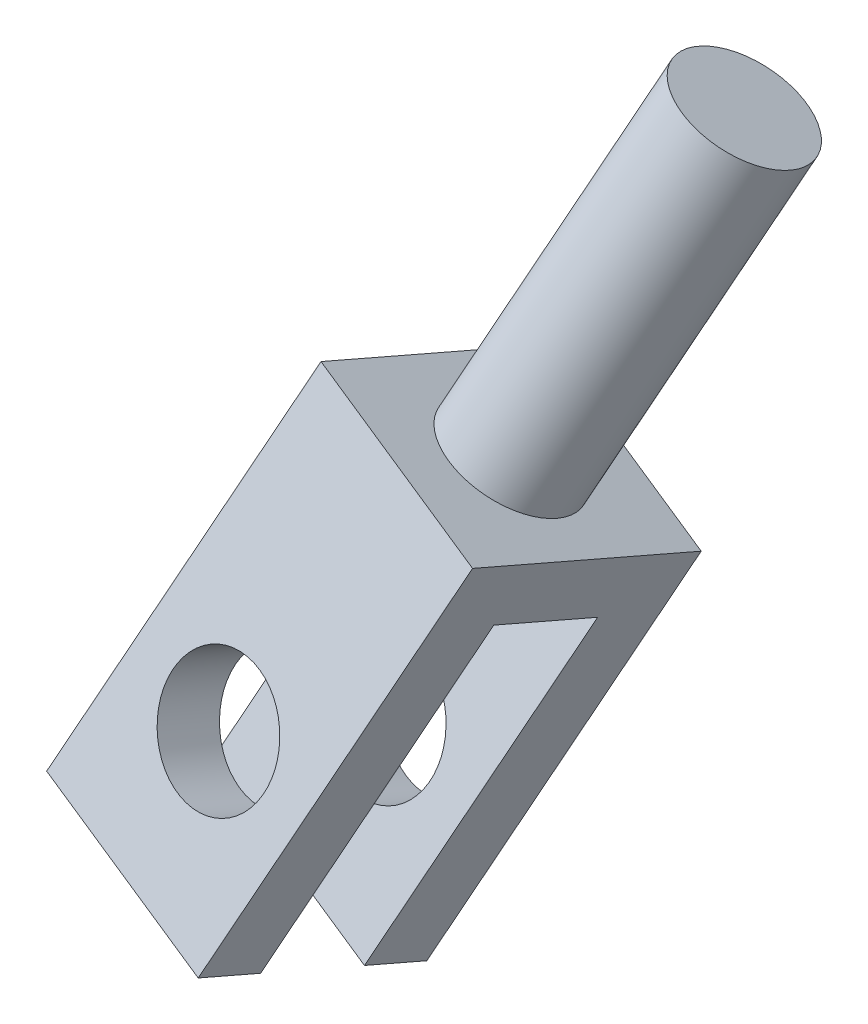
ISO-10303-21;
HEADER;
FILE_DESCRIPTION(('STEP AP214'),'2;1');
FILE_NAME('part.step','',(''),(''),'','','');
FILE_SCHEMA(('AUTOMOTIVE_DESIGN { 1 0 10303 214 1 1 1 1 }'));
ENDSEC;
DATA;
#1=APPLICATION_CONTEXT('core data for automotive mechanical design processes');
#2=APPLICATION_PROTOCOL_DEFINITION('international standard','automotive_design',2000,#1);
#3=PRODUCT_CONTEXT('',#1,'mechanical');
#4=PRODUCT('Part','Part','',(#3));
#5=PRODUCT_RELATED_PRODUCT_CATEGORY('part','',(#4));
#6=PRODUCT_DEFINITION_FORMATION('','',#4);
#7=PRODUCT_DEFINITION_CONTEXT('part definition',#1,'design');
#8=PRODUCT_DEFINITION('design','',#6,#7);
#9=PRODUCT_DEFINITION_SHAPE('','',#8);
#10=(LENGTH_UNIT() NAMED_UNIT(*) SI_UNIT(.MILLI.,.METRE.));
#11=(NAMED_UNIT(*) PLANE_ANGLE_UNIT() SI_UNIT($,.RADIAN.));
#12=(NAMED_UNIT(*) SI_UNIT($,.STERADIAN.) SOLID_ANGLE_UNIT());
#13=UNCERTAINTY_MEASURE_WITH_UNIT(LENGTH_MEASURE(1.E-05),#10,'distance_accuracy_value','');
#14=(GEOMETRIC_REPRESENTATION_CONTEXT(3) GLOBAL_UNCERTAINTY_ASSIGNED_CONTEXT((#13)) GLOBAL_UNIT_ASSIGNED_CONTEXT((#10,
#11,#12)) REPRESENTATION_CONTEXT('',''));
#15=CARTESIAN_POINT('',(0.,0.,0.));
#16=DIRECTION('',(0.,0.,1.));
#17=DIRECTION('',(1.,0.,0.));
#18=AXIS2_PLACEMENT_3D('',#15,#16,#17);
#19=CARTESIAN_POINT('',(636.080806585949,8.59855871838625,-207.638908513672));
#20=DIRECTION('',(0.354162422945148,0.881836565444647,-0.311341050968886));
#21=DIRECTION('',(-0.927957693562159,0.372685549704839,0.));
#22=AXIS2_PLACEMENT_3D('',#19,#20,#21);
#23=PLANE('',#22);
#24=DIRECTION('',(-0.0784836857791925,0.359772078695606,0.929733490016121));
#25=VECTOR('',#24,1.);
#26=CARTESIAN_POINT('',(645.399654633,5.55014399535678,-205.672633163574));
#27=LINE('',#26,#25);
#28=CARTESIAN_POINT('',(645.399654633,5.55014399535678,-205.672633163574));
#29=VERTEX_POINT('',#28);
#30=CARTESIAN_POINT('',(645.164203575662,6.62946023144359,-202.883432693526));
#31=VERTEX_POINT('',#30);
#32=EDGE_CURVE('E138',#29,#31,#27,.T.);
#33=ORIENTED_EDGE('',*,*,#32,.T.);
#34=DIRECTION('',(0.93188480470503,-0.304841472302947,0.196627535009822));
#35=VECTOR('',#34,1.);
#36=CARTESIAN_POINT('',(635.845355528612,9.67787495447306,-204.849708043624));
#37=LINE('',#36,#35);
#38=CARTESIAN_POINT('',(635.845355528612,9.67787495447306,-204.849708043624));
#39=VERTEX_POINT('',#38);
#40=EDGE_CURVE('E48',#39,#31,#37,.T.);
#41=ORIENTED_EDGE('',*,*,#40,.F.);
#42=DIRECTION('',(-0.0784836857791925,0.359772078695606,0.929733490016121));
#43=VECTOR('',#42,1.);
#44=CARTESIAN_POINT('',(636.080806585949,8.59855871838625,-207.638908513672));
#45=LINE('',#44,#43);
#46=CARTESIAN_POINT('',(636.080806585949,8.59855871838625,-207.638908513672));
#47=VERTEX_POINT('',#46);
#48=EDGE_CURVE('E153',#47,#39,#45,.T.);
#49=ORIENTED_EDGE('',*,*,#48,.F.);
#50=DIRECTION('',(0.93188480470503,-0.304841472302947,0.196627535009822));
#51=VECTOR('',#50,1.);
#52=CARTESIAN_POINT('',(636.080806585949,8.59855871838625,-207.638908513672));
#53=LINE('',#52,#51);
#54=EDGE_CURVE('E134',#47,#29,#53,.T.);
#55=ORIENTED_EDGE('',*,*,#54,.T.);
#56=EDGE_LOOP('',(#33,#41,#49,#55));
#57=FACE_BOUND('',#56,.T.);
#58=ADVANCED_FACE('F39',(#57),#23,.F.);
#59=CARTESIAN_POINT('',(635.845355528612,9.67787495447306,-204.849708043624));
#60=DIRECTION('',(0.0784836857792088,-0.359772078695604,-0.92973349001612));
#61=DIRECTION('',(0.,0.932610221230822,-0.36088526605529));
#62=AXIS2_PLACEMENT_3D('',#59,#60,#61);
#63=PLANE('',#62);
#64=CARTESIAN_POINT('',(642.983916512753,14.3265235510708,-206.045957725357));
#65=DIRECTION('',(0.0784836857792088,-0.359772078695604,-0.92973349001612));
#66=DIRECTION('',(0.,0.932610221230822,-0.36088526605529));
#67=AXIS2_PLACEMENT_3D('',#64,#65,#66);
#68=CIRCLE('',#67,3.00000000000005);
#69=CARTESIAN_POINT('',(642.983916512753,17.1243542147634,-207.128613523523));
#70=VERTEX_POINT('',#69);
#71=EDGE_CURVE('E142',#70,#70,#68,.T.);
#72=ORIENTED_EDGE('',*,*,#71,.T.);
#73=EDGE_LOOP('',(#72));
#74=FACE_BOUND('',#73,.T.);
#75=DIRECTION('',(0.354162422945148,0.88183656544465,-0.31134105096888));
#76=VECTOR('',#75,1.);
#77=CARTESIAN_POINT('',(645.164203575662,6.62946023144359,-202.883432693526));
#78=LINE('',#77,#76);
#79=CARTESIAN_POINT('',(652.247452034565,24.2661915403366,-209.110253712903));
#80=VERTEX_POINT('',#79);
#81=EDGE_CURVE('E141',#31,#80,#78,.T.);
#82=ORIENTED_EDGE('',*,*,#81,.T.);
#83=DIRECTION('',(0.93188480470503,-0.304841472302947,0.196627535009822));
#84=VECTOR('',#83,1.);
#85=CARTESIAN_POINT('',(642.928603987515,27.3146062633661,-211.076529063002));
#86=LINE('',#85,#84);
#87=CARTESIAN_POINT('',(642.928603987515,27.3146062633661,-211.076529063002));
#88=VERTEX_POINT('',#87);
#89=EDGE_CURVE('E163',#88,#80,#86,.T.);
#90=ORIENTED_EDGE('',*,*,#89,.F.);
#91=DIRECTION('',(0.354162422945148,0.88183656544465,-0.31134105096888));
#92=VECTOR('',#91,1.);
#93=CARTESIAN_POINT('',(635.845355528612,9.67787495447306,-204.849708043624));
#94=LINE('',#93,#92);
#95=EDGE_CURVE('E101',#39,#88,#94,.T.);
#96=ORIENTED_EDGE('',*,*,#95,.F.);
#97=ORIENTED_EDGE('',*,*,#40,.T.);
#98=EDGE_LOOP('',(#82,#90,#96,#97));
#99=FACE_BOUND('',#98,.T.);
#100=ADVANCED_FACE('F166',(#74,#99),#63,.F.);
#101=CARTESIAN_POINT('',(642.928603987515,27.3146062633661,-211.076529063002));
#102=DIRECTION('',(-0.354162422945148,-0.881836565444649,0.311341050968882));
#103=DIRECTION('',(0.927957693562159,-0.372685549704838,0.));
#104=AXIS2_PLACEMENT_3D('',#101,#102,#103);
#105=PLANE('',#104);
#106=CARTESIAN_POINT('',(648.019688282826,23.8116524690256,-215.206925583041));
#107=DIRECTION('',(0.354162422945148,0.881836565444649,-0.311341050968882));
#108=DIRECTION('',(-0.927957693562159,0.372685549704838,0.));
#109=AXIS2_PLACEMENT_3D('',#106,#107,#108);
#110=CIRCLE('',#109,3.00000000000005);
#111=CARTESIAN_POINT('',(645.235815202139,24.9297091181401,-215.206925583041));
#112=VERTEX_POINT('',#111);
#113=EDGE_CURVE('E11',#112,#112,#110,.T.);
#114=ORIENTED_EDGE('',*,*,#113,.F.);
#115=EDGE_LOOP('',(#114));
#116=FACE_BOUND('',#115,.T.);
#117=DIRECTION('',(0.0784836857792091,-0.359772078695606,-0.929733490016119));
#118=VECTOR('',#117,1.);
#119=CARTESIAN_POINT('',(652.247452034565,24.2661915403366,-209.110253712903));
#120=LINE('',#119,#118);
#121=CARTESIAN_POINT('',(653.110772578136,20.3086986746849,-219.337322103081));
#122=VERTEX_POINT('',#121);
#123=EDGE_CURVE('E144',#80,#122,#120,.T.);
#124=ORIENTED_EDGE('',*,*,#123,.T.);
#125=DIRECTION('',(0.93188480470503,-0.304841472302947,0.196627535009822));
#126=VECTOR('',#125,1.);
#127=CARTESIAN_POINT('',(643.791924531086,23.3571133977144,-221.303597453179));
#128=LINE('',#127,#126);
#129=CARTESIAN_POINT('',(643.791924531086,23.3571133977144,-221.303597453179));
#130=VERTEX_POINT('',#129);
#131=EDGE_CURVE('E160',#130,#122,#128,.T.);
#132=ORIENTED_EDGE('',*,*,#131,.F.);
#133=DIRECTION('',(0.0784836857792091,-0.359772078695606,-0.929733490016119));
#134=VECTOR('',#133,1.);
#135=CARTESIAN_POINT('',(642.928603987515,27.3146062633661,-211.076529063002));
#136=LINE('',#135,#134);
#137=EDGE_CURVE('E184',#88,#130,#136,.T.);
#138=ORIENTED_EDGE('',*,*,#137,.F.);
#139=ORIENTED_EDGE('',*,*,#89,.T.);
#140=EDGE_LOOP('',(#124,#132,#138,#139));
#141=FACE_BOUND('',#140,.T.);
#142=ADVANCED_FACE('F177',(#116,#141),#105,.F.);
#143=CARTESIAN_POINT('',(643.791924531086,23.3571133977144,-221.303597453179));
#144=DIRECTION('',(-0.0784836857792086,0.359772078695605,0.92973349001612));
#145=DIRECTION('',(0.,-0.932610221230822,0.36088526605529));
#146=AXIS2_PLACEMENT_3D('',#143,#144,#145);
#147=PLANE('',#146);
#148=CARTESIAN_POINT('',(643.847237056324,10.3690306854192,-216.273026115534));
#149=DIRECTION('',(-0.0784836857792086,0.359772078695605,0.92973349001612));
#150=DIRECTION('',(0.,-0.932610221230822,0.36088526605529));
#151=AXIS2_PLACEMENT_3D('',#148,#149,#150);
#152=CIRCLE('',#151,3.00000000000005);
#153=CARTESIAN_POINT('',(643.847237056324,7.57120002172667,-215.190370317369));
#154=VERTEX_POINT('',#153);
#155=EDGE_CURVE('E192',#154,#154,#152,.T.);
#156=ORIENTED_EDGE('',*,*,#155,.T.);
#157=EDGE_LOOP('',(#156));
#158=FACE_BOUND('',#157,.T.);
#159=DIRECTION('',(-0.354162422945148,-0.881836565444649,0.31134105096888));
#160=VECTOR('',#159,1.);
#161=CARTESIAN_POINT('',(653.110772578136,20.3086986746849,-219.337322103081));
#162=LINE('',#161,#160);
#163=CARTESIAN_POINT('',(646.027524119233,2.67196736579195,-213.110501083703));
#164=VERTEX_POINT('',#163);
#165=EDGE_CURVE('E146',#122,#164,#162,.T.);
#166=ORIENTED_EDGE('',*,*,#165,.T.);
#167=DIRECTION('',(0.93188480470503,-0.304841472302947,0.196627535009822));
#168=VECTOR('',#167,1.);
#169=CARTESIAN_POINT('',(636.708676072183,5.72038208882142,-215.076776433801));
#170=LINE('',#169,#168);
#171=CARTESIAN_POINT('',(636.708676072183,5.72038208882142,-215.076776433801));
#172=VERTEX_POINT('',#171);
#173=EDGE_CURVE('E157',#172,#164,#170,.T.);
#174=ORIENTED_EDGE('',*,*,#173,.F.);
#175=DIRECTION('',(-0.354162422945148,-0.881836565444649,0.31134105096888));
#176=VECTOR('',#175,1.);
#177=CARTESIAN_POINT('',(643.791924531086,23.3571133977144,-221.303597453179));
#178=LINE('',#177,#176);
#179=EDGE_CURVE('E183',#130,#172,#178,.T.);
#180=ORIENTED_EDGE('',*,*,#179,.F.);
#181=ORIENTED_EDGE('',*,*,#131,.T.);
#182=EDGE_LOOP('',(#166,#174,#180,#181));
#183=FACE_BOUND('',#182,.T.);
#184=ADVANCED_FACE('F181',(#158,#183),#147,.F.);
#185=CARTESIAN_POINT('',(636.708676072183,5.72038208882142,-215.076776433801));
#186=DIRECTION('',(0.354162422945147,0.881836565444652,-0.311341050968874));
#187=DIRECTION('',(-0.92795769356216,0.372685549704837,0.));
#188=AXIS2_PLACEMENT_3D('',#185,#186,#187);
#189=PLANE('',#188);
#190=DIRECTION('',(-0.0784836857792293,0.359772078695605,0.929733490016118));
#191=VECTOR('',#190,1.);
#192=CARTESIAN_POINT('',(646.027524119233,2.67196736579195,-213.110501083703));
#193=LINE('',#192,#191);
#194=CARTESIAN_POINT('',(645.792073061896,3.75128360187876,-210.321300613655));
#195=VERTEX_POINT('',#194);
#196=EDGE_CURVE('E148',#164,#195,#193,.T.);
#197=ORIENTED_EDGE('',*,*,#196,.T.);
#198=DIRECTION('',(0.93188480470503,-0.304841472302947,0.196627535009822));
#199=VECTOR('',#198,1.);
#200=CARTESIAN_POINT('',(636.473225014846,6.79969832490824,-212.287575963753));
#201=LINE('',#200,#199);
#202=CARTESIAN_POINT('',(636.473225014846,6.79969832490824,-212.287575963753));
#203=VERTEX_POINT('',#202);
#204=EDGE_CURVE('E129',#203,#195,#201,.T.);
#205=ORIENTED_EDGE('',*,*,#204,.F.);
#206=DIRECTION('',(-0.0784836857792293,0.359772078695605,0.929733490016118));
#207=VECTOR('',#206,1.);
#208=CARTESIAN_POINT('',(636.708676072183,5.72038208882142,-215.076776433801));
#209=LINE('',#208,#207);
#210=EDGE_CURVE('E120',#172,#203,#209,.T.);
#211=ORIENTED_EDGE('',*,*,#210,.F.);
#212=ORIENTED_EDGE('',*,*,#173,.T.);
#213=EDGE_LOOP('',(#197,#205,#211,#212));
#214=FACE_BOUND('',#213,.T.);
#215=ADVANCED_FACE('F225',(#214),#189,.F.);
#216=CARTESIAN_POINT('',(636.473225014846,6.79969832490824,-212.287575963753));
#217=DIRECTION('',(0.0784836857792086,-0.359772078695605,-0.92973349001612));
#218=DIRECTION('',(0.,0.932610221230822,-0.36088526605529));
#219=AXIS2_PLACEMENT_3D('',#216,#217,#218);
#220=PLANE('',#219);
#221=CARTESIAN_POINT('',(643.611785998987,11.448346921506,-213.483825645486));
#222=DIRECTION('',(0.0784836857792086,-0.359772078695605,-0.92973349001612));
#223=DIRECTION('',(0.,0.932610221230822,-0.36088526605529));
#224=AXIS2_PLACEMENT_3D('',#221,#222,#223);
#225=CIRCLE('',#224,3.00000000000005);
#226=CARTESIAN_POINT('',(643.611785998987,14.2461775851985,-214.566481443652));
#227=VERTEX_POINT('',#226);
#228=EDGE_CURVE('E195',#227,#227,#225,.T.);
#229=ORIENTED_EDGE('',*,*,#228,.T.);
#230=EDGE_LOOP('',(#229));
#231=FACE_BOUND('',#230,.T.);
#232=DIRECTION('',(0.35416242294515,0.881836565444648,-0.31134105096888));
#233=VECTOR('',#232,1.);
#234=CARTESIAN_POINT('',(645.792073061896,3.75128360187876,-210.321300613655));
#235=LINE('',#234,#233);
#236=CARTESIAN_POINT('',(651.812834251963,18.7425052144378,-215.614098480126));
#237=VERTEX_POINT('',#236);
#238=EDGE_CURVE('E128',#195,#237,#235,.T.);
#239=ORIENTED_EDGE('',*,*,#238,.T.);
#240=DIRECTION('',(0.93188480470503,-0.304841472302947,0.196627535009822));
#241=VECTOR('',#240,1.);
#242=CARTESIAN_POINT('',(642.493986204913,21.7909199374673,-217.580373830224));
#243=LINE('',#242,#241);
#244=CARTESIAN_POINT('',(642.493986204913,21.7909199374673,-217.580373830224));
#245=VERTEX_POINT('',#244);
#246=EDGE_CURVE('E125',#245,#237,#243,.T.);
#247=ORIENTED_EDGE('',*,*,#246,.F.);
#248=DIRECTION('',(0.35416242294515,0.881836565444648,-0.31134105096888));
#249=VECTOR('',#248,1.);
#250=CARTESIAN_POINT('',(636.473225014846,6.79969832490824,-212.287575963753));
#251=LINE('',#250,#249);
#252=EDGE_CURVE('E114',#203,#245,#251,.T.);
#253=ORIENTED_EDGE('',*,*,#252,.F.);
#254=ORIENTED_EDGE('',*,*,#204,.T.);
#255=EDGE_LOOP('',(#239,#247,#253,#254));
#256=FACE_BOUND('',#255,.T.);
#257=ADVANCED_FACE('F126',(#231,#256),#220,.F.);
#258=CARTESIAN_POINT('',(642.493986204913,21.7909199374673,-217.580373830224));
#259=DIRECTION('',(0.354162422945148,0.88183656544465,-0.311341050968879));
#260=DIRECTION('',(-0.92795769356216,0.372685549704838,0.));
#261=AXIS2_PLACEMENT_3D('',#258,#259,#260);
#262=PLANE('',#261);
#263=DIRECTION('',(-0.078483685779207,0.359772078695602,0.929733490016121));
#264=VECTOR('',#263,1.);
#265=CARTESIAN_POINT('',(651.812834251963,18.7425052144378,-215.614098480126));
#266=LINE('',#265,#264);
#267=CARTESIAN_POINT('',(651.420415823067,20.5413656079158,-210.965431030045));
#268=VERTEX_POINT('',#267);
#269=EDGE_CURVE('E86',#237,#268,#266,.T.);
#270=ORIENTED_EDGE('',*,*,#269,.T.);
#271=DIRECTION('',(0.93188480470503,-0.304841472302947,0.196627535009822));
#272=VECTOR('',#271,1.);
#273=CARTESIAN_POINT('',(642.101567776017,23.5897803309453,-212.931706380143));
#274=LINE('',#273,#272);
#275=CARTESIAN_POINT('',(642.101567776017,23.5897803309453,-212.931706380143));
#276=VERTEX_POINT('',#275);
#277=EDGE_CURVE('E130',#276,#268,#274,.T.);
#278=ORIENTED_EDGE('',*,*,#277,.F.);
#279=DIRECTION('',(-0.078483685779207,0.359772078695602,0.929733490016121));
#280=VECTOR('',#279,1.);
#281=CARTESIAN_POINT('',(642.493986204913,21.7909199374673,-217.580373830224));
#282=LINE('',#281,#280);
#283=EDGE_CURVE('E118',#245,#276,#282,.T.);
#284=ORIENTED_EDGE('',*,*,#283,.F.);
#285=ORIENTED_EDGE('',*,*,#246,.T.);
#286=EDGE_LOOP('',(#270,#278,#284,#285));
#287=FACE_BOUND('',#286,.T.);
#288=ADVANCED_FACE('F132',(#287),#262,.F.);
#289=CARTESIAN_POINT('',(642.101567776017,23.5897803309453,-212.931706380143));
#290=DIRECTION('',(-0.0784836857792086,0.359772078695605,0.92973349001612));
#291=DIRECTION('',(0.,-0.932610221230822,0.36088526605529));
#292=AXIS2_PLACEMENT_3D('',#289,#290,#291);
#293=PLANE('',#292);
#294=CARTESIAN_POINT('',(643.219367570091,13.247207314984,-208.835158195405));
#295=DIRECTION('',(-0.0784836857792086,0.359772078695605,0.92973349001612));
#296=DIRECTION('',(0.,-0.932610221230822,0.36088526605529));
#297=AXIS2_PLACEMENT_3D('',#294,#295,#296);
#298=CIRCLE('',#297,3.00000000000005);
#299=CARTESIAN_POINT('',(643.219367570091,10.4493766512915,-207.75250239724));
#300=VERTEX_POINT('',#299);
#301=EDGE_CURVE('E42',#300,#300,#298,.T.);
#302=ORIENTED_EDGE('',*,*,#301,.T.);
#303=EDGE_LOOP('',(#302));
#304=FACE_BOUND('',#303,.T.);
#305=DIRECTION('',(-0.35416242294515,-0.881836565444648,0.31134105096888));
#306=VECTOR('',#305,1.);
#307=CARTESIAN_POINT('',(651.420415823067,20.5413656079158,-210.965431030045));
#308=LINE('',#307,#306);
#309=EDGE_CURVE('E92',#268,#29,#308,.T.);
#310=ORIENTED_EDGE('',*,*,#309,.T.);
#311=ORIENTED_EDGE('',*,*,#54,.F.);
#312=DIRECTION('',(-0.35416242294515,-0.881836565444648,0.31134105096888));
#313=VECTOR('',#312,1.);
#314=CARTESIAN_POINT('',(642.101567776017,23.5897803309453,-212.931706380143));
#315=LINE('',#314,#313);
#316=EDGE_CURVE('E57',#276,#47,#315,.T.);
#317=ORIENTED_EDGE('',*,*,#316,.F.);
#318=ORIENTED_EDGE('',*,*,#277,.T.);
#319=EDGE_LOOP('',(#310,#311,#317,#318));
#320=FACE_BOUND('',#319,.T.);
#321=ADVANCED_FACE('F205',(#304,#320),#293,.F.);
#322=CARTESIAN_POINT('',(511.889275418187,-167.451040715236,108.008549892917));
#323=DIRECTION('',(-0.931884804705032,0.304841472302952,-0.196627535009808));
#324=DIRECTION('',(-0.310910996875678,-0.950439031196516,0.));
#325=AXIS2_PLACEMENT_3D('',#322,#323,#324);
#326=PLANE('',#325);
#327=ORIENTED_EDGE('',*,*,#48,.T.);
#328=ORIENTED_EDGE('',*,*,#95,.T.);
#329=ORIENTED_EDGE('',*,*,#137,.T.);
#330=ORIENTED_EDGE('',*,*,#179,.T.);
#331=ORIENTED_EDGE('',*,*,#210,.T.);
#332=ORIENTED_EDGE('',*,*,#252,.T.);
#333=ORIENTED_EDGE('',*,*,#283,.T.);
#334=ORIENTED_EDGE('',*,*,#316,.T.);
#335=EDGE_LOOP('',(#327,#328,#329,#330,#331,#332,#333,#334));
#336=FACE_BOUND('',#335,.T.);
#337=ADVANCED_FACE('F116',(#336),#326,.T.);
#338=CARTESIAN_POINT('',(521.208123465238,-170.499455438265,109.974825243015));
#339=DIRECTION('',(-0.931884804705032,0.304841472302952,-0.196627535009808));
#340=DIRECTION('',(-0.310910996875678,-0.950439031196516,0.));
#341=AXIS2_PLACEMENT_3D('',#338,#339,#340);
#342=PLANE('',#341);
#343=ORIENTED_EDGE('',*,*,#32,.F.);
#344=ORIENTED_EDGE('',*,*,#309,.F.);
#345=ORIENTED_EDGE('',*,*,#269,.F.);
#346=ORIENTED_EDGE('',*,*,#238,.F.);
#347=ORIENTED_EDGE('',*,*,#196,.F.);
#348=ORIENTED_EDGE('',*,*,#165,.F.);
#349=ORIENTED_EDGE('',*,*,#123,.F.);
#350=ORIENTED_EDGE('',*,*,#81,.F.);
#351=EDGE_LOOP('',(#343,#344,#345,#346,#347,#348,#349,#350));
#352=FACE_BOUND('',#351,.T.);
#353=ADVANCED_FACE('F171',(#352),#342,.F.);
#354=CARTESIAN_POINT('',(642.342444585081,17.2670542684057,-198.446952554529));
#355=DIRECTION('',(0.0784836857792086,-0.359772078695605,-0.929733490016119));
#356=DIRECTION('',(0.,0.932610221230822,-0.36088526605529));
#357=AXIS2_PLACEMENT_3D('',#354,#355,#356);
#358=CYLINDRICAL_SURFACE('',#357,3.00000000000005);
#359=ORIENTED_EDGE('',*,*,#301,.F.);
#360=EDGE_LOOP('',(#359));
#361=FACE_BOUND('',#360,.T.);
#362=ORIENTED_EDGE('',*,*,#71,.F.);
#363=EDGE_LOOP('',(#362));
#364=FACE_BOUND('',#363,.T.);
#365=ADVANCED_FACE('F207',(#361,#364),#358,.F.);
#366=ORIENTED_EDGE('',*,*,#228,.F.);
#367=EDGE_LOOP('',(#366));
#368=FACE_BOUND('',#367,.T.);
#369=ORIENTED_EDGE('',*,*,#155,.F.);
#370=EDGE_LOOP('',(#369));
#371=FACE_BOUND('',#370,.T.);
#372=ADVANCED_FACE('F210',(#368,#371),#358,.F.);
#373=CARTESIAN_POINT('',(654.040449472893,38.8028740815846,-220.499723449512));
#374=DIRECTION('',(-0.354162422945148,-0.881836565444649,0.311341050968882));
#375=DIRECTION('',(0.927957693562159,-0.372685549704838,0.));
#376=AXIS2_PLACEMENT_3D('',#373,#374,#375);
#377=CYLINDRICAL_SURFACE('',#376,3.00000000000005);
#378=CARTESIAN_POINT('',(654.040449472893,38.8028740815846,-220.499723449512));
#379=DIRECTION('',(0.354162422945148,0.881836565444649,-0.311341050968882));
#380=DIRECTION('',(-0.927957693562159,0.372685549704838,0.));
#381=AXIS2_PLACEMENT_3D('',#378,#379,#380);
#382=CIRCLE('',#381,3.00000000000005);
#383=CARTESIAN_POINT('',(651.256576392207,39.9209307306991,-220.499723449512));
#384=VERTEX_POINT('',#383);
#385=EDGE_CURVE('E198',#384,#384,#382,.T.);
#386=ORIENTED_EDGE('',*,*,#385,.F.);
#387=EDGE_LOOP('',(#386));
#388=FACE_BOUND('',#387,.T.);
#389=ORIENTED_EDGE('',*,*,#113,.T.);
#390=EDGE_LOOP('',(#389));
#391=FACE_BOUND('',#390,.T.);
#392=ADVANCED_FACE('F241',(#388,#391),#377,.T.);
#393=CARTESIAN_POINT('',(654.040449472893,38.8028740815846,-220.499723449512));
#394=DIRECTION('',(0.354162422945148,0.881836565444649,-0.311341050968882));
#395=DIRECTION('',(-0.927957693562159,0.372685549704838,0.));
#396=AXIS2_PLACEMENT_3D('',#393,#394,#395);
#397=PLANE('',#396);
#398=ORIENTED_EDGE('',*,*,#385,.T.);
#399=EDGE_LOOP('',(#398));
#400=FACE_BOUND('',#399,.T.);
#401=ADVANCED_FACE('F244',(#400),#397,.T.);
#402=CLOSED_SHELL('',(#58,#100,#142,#184,#215,#257,#288,#321,#337,#353,#365,#372,#392,#401));
#403=MANIFOLD_SOLID_BREP('B2',#402);
#404=ADVANCED_BREP_SHAPE_REPRESENTATION('',(#18,#403),#14);
#405=SHAPE_DEFINITION_REPRESENTATION(#9,#404);
ENDSEC;
END-ISO-10303-21;
